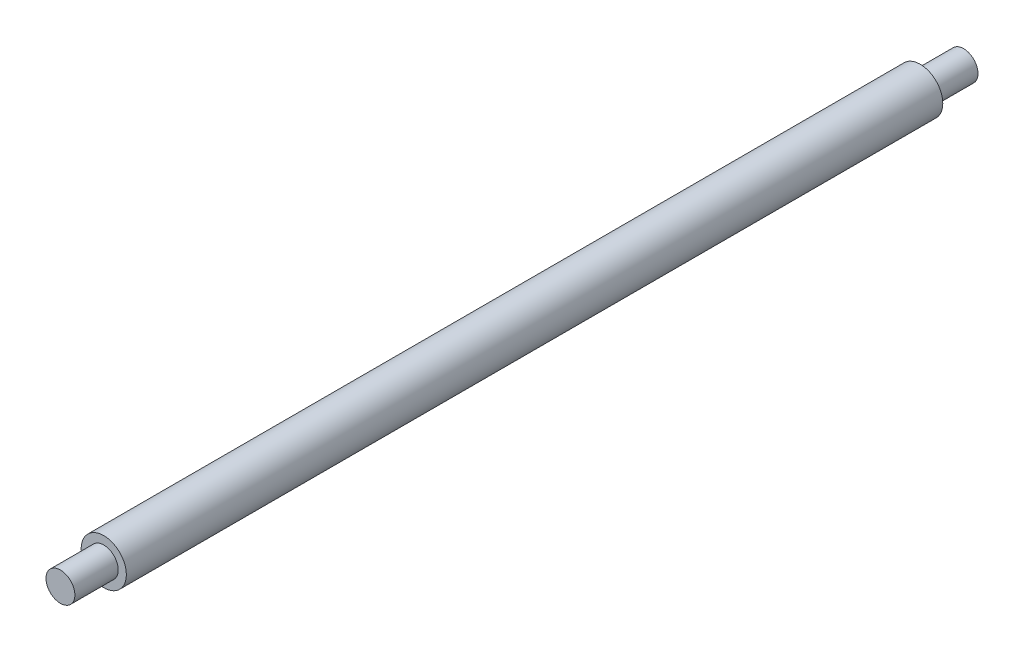
ISO-10303-21;
HEADER;
FILE_DESCRIPTION(('STEP AP214'),'2;1');
FILE_NAME('part.step','',(''),(''),'','','');
FILE_SCHEMA(('AUTOMOTIVE_DESIGN { 1 0 10303 214 1 1 1 1 }'));
ENDSEC;
DATA;
#1=APPLICATION_CONTEXT('core data for automotive mechanical design processes');
#2=APPLICATION_PROTOCOL_DEFINITION('international standard','automotive_design',2000,#1);
#3=PRODUCT_CONTEXT('',#1,'mechanical');
#4=PRODUCT('Part','Part','',(#3));
#5=PRODUCT_RELATED_PRODUCT_CATEGORY('part','',(#4));
#6=PRODUCT_DEFINITION_FORMATION('','',#4);
#7=PRODUCT_DEFINITION_CONTEXT('part definition',#1,'design');
#8=PRODUCT_DEFINITION('design','',#6,#7);
#9=PRODUCT_DEFINITION_SHAPE('','',#8);
#10=(LENGTH_UNIT() NAMED_UNIT(*) SI_UNIT(.MILLI.,.METRE.));
#11=(NAMED_UNIT(*) PLANE_ANGLE_UNIT() SI_UNIT($,.RADIAN.));
#12=(NAMED_UNIT(*) SI_UNIT($,.STERADIAN.) SOLID_ANGLE_UNIT());
#13=UNCERTAINTY_MEASURE_WITH_UNIT(LENGTH_MEASURE(1.E-05),#10,'distance_accuracy_value','');
#14=(GEOMETRIC_REPRESENTATION_CONTEXT(3) GLOBAL_UNCERTAINTY_ASSIGNED_CONTEXT((#13)) GLOBAL_UNIT_ASSIGNED_CONTEXT((#10,
#11,#12)) REPRESENTATION_CONTEXT('',''));
#15=CARTESIAN_POINT('',(0.,0.,0.));
#16=DIRECTION('',(0.,0.,1.));
#17=DIRECTION('',(1.,0.,0.));
#18=AXIS2_PLACEMENT_3D('',#15,#16,#17);
#19=CARTESIAN_POINT('',(0.,0.,-50.));
#20=DIRECTION('',(0.,0.,1.));
#21=DIRECTION('',(1.,0.,0.));
#22=AXIS2_PLACEMENT_3D('',#19,#20,#21);
#23=PLANE('',#22);
#24=CARTESIAN_POINT('',(0.,0.,-50.));
#25=DIRECTION('',(0.,0.,1.));
#26=DIRECTION('',(1.,0.,0.));
#27=AXIS2_PLACEMENT_3D('',#24,#25,#26);
#28=CIRCLE('',#27,0.800000000000001);
#29=CARTESIAN_POINT('',(0.800000000000001,0.,-50.));
#30=VERTEX_POINT('',#29);
#31=EDGE_CURVE('E18',#30,#30,#28,.T.);
#32=ORIENTED_EDGE('',*,*,#31,.F.);
#33=EDGE_LOOP('',(#32));
#34=FACE_BOUND('',#33,.T.);
#35=ADVANCED_FACE('F15',(#34),#23,.F.);
#36=CARTESIAN_POINT('',(0.,0.800000000000003,0.));
#37=DIRECTION('',(0.,0.,-1.));
#38=DIRECTION('',(-1.,0.,0.));
#39=AXIS2_PLACEMENT_3D('',#36,#37,#38);
#40=PLANE('',#39);
#41=CARTESIAN_POINT('',(0.,0.,0.));
#42=DIRECTION('',(0.,0.,1.));
#43=DIRECTION('',(1.,0.,0.));
#44=AXIS2_PLACEMENT_3D('',#41,#42,#43);
#45=CIRCLE('',#44,0.800000000000002);
#46=CARTESIAN_POINT('',(0.800000000000002,0.,0.));
#47=VERTEX_POINT('',#46);
#48=EDGE_CURVE('E34',#47,#47,#45,.F.);
#49=ORIENTED_EDGE('',*,*,#48,.F.);
#50=EDGE_LOOP('',(#49));
#51=FACE_BOUND('',#50,.T.);
#52=ADVANCED_FACE('F44',(#51),#40,.F.);
#53=CARTESIAN_POINT('',(0.,0.,0.));
#54=DIRECTION('',(0.,0.,1.));
#55=DIRECTION('',(1.,0.,0.));
#56=AXIS2_PLACEMENT_3D('',#53,#54,#55);
#57=CYLINDRICAL_SURFACE('',#56,0.800000000000001);
#58=CARTESIAN_POINT('',(0.,0.,-47.5999999999999));
#59=DIRECTION('',(0.,0.,1.));
#60=DIRECTION('',(1.,0.,0.));
#61=AXIS2_PLACEMENT_3D('',#58,#59,#60);
#62=CIRCLE('',#61,0.800000000000001);
#63=CARTESIAN_POINT('',(0.800000000000001,0.,-47.5999999999999));
#64=VERTEX_POINT('',#63);
#65=EDGE_CURVE('E32',#64,#64,#62,.F.);
#66=ORIENTED_EDGE('',*,*,#65,.T.);
#67=EDGE_LOOP('',(#66));
#68=FACE_BOUND('',#67,.T.);
#69=ORIENTED_EDGE('',*,*,#31,.T.);
#70=EDGE_LOOP('',(#69));
#71=FACE_BOUND('',#70,.T.);
#72=ADVANCED_FACE('F41',(#68,#71),#57,.T.);
#73=CARTESIAN_POINT('',(0.,0.,0.));
#74=DIRECTION('',(0.,0.,1.));
#75=DIRECTION('',(1.,0.,0.));
#76=AXIS2_PLACEMENT_3D('',#73,#74,#75);
#77=CYLINDRICAL_SURFACE('',#76,0.800000000000002);
#78=ORIENTED_EDGE('',*,*,#48,.T.);
#79=EDGE_LOOP('',(#78));
#80=FACE_BOUND('',#79,.T.);
#81=CARTESIAN_POINT('',(0.,0.,-2.4));
#82=DIRECTION('',(0.,0.,1.));
#83=DIRECTION('',(1.,0.,0.));
#84=AXIS2_PLACEMENT_3D('',#81,#82,#83);
#85=CIRCLE('',#84,0.800000000000002);
#86=CARTESIAN_POINT('',(0.800000000000002,0.,-2.4));
#87=VERTEX_POINT('',#86);
#88=EDGE_CURVE('E27',#87,#87,#85,.T.);
#89=ORIENTED_EDGE('',*,*,#88,.T.);
#90=EDGE_LOOP('',(#89));
#91=FACE_BOUND('',#90,.T.);
#92=ADVANCED_FACE('F64',(#80,#91),#77,.T.);
#93=CARTESIAN_POINT('',(0.,0.800000000000002,-47.5999999999999));
#94=DIRECTION('',(0.,0.,1.));
#95=DIRECTION('',(1.,0.,0.));
#96=AXIS2_PLACEMENT_3D('',#93,#94,#95);
#97=PLANE('',#96);
#98=ORIENTED_EDGE('',*,*,#65,.F.);
#99=EDGE_LOOP('',(#98));
#100=FACE_BOUND('',#99,.T.);
#101=CARTESIAN_POINT('',(0.,0.,-47.5999999999999));
#102=DIRECTION('',(0.,0.,1.));
#103=DIRECTION('',(1.,0.,0.));
#104=AXIS2_PLACEMENT_3D('',#101,#102,#103);
#105=CIRCLE('',#104,1.25);
#106=CARTESIAN_POINT('',(1.25,0.,-47.5999999999999));
#107=VERTEX_POINT('',#106);
#108=EDGE_CURVE('E22',#107,#107,#105,.T.);
#109=ORIENTED_EDGE('',*,*,#108,.F.);
#110=EDGE_LOOP('',(#109));
#111=FACE_BOUND('',#110,.T.);
#112=ADVANCED_FACE('F57',(#100,#111),#97,.F.);
#113=CARTESIAN_POINT('',(0.,1.24999999999999,-2.4));
#114=DIRECTION('',(0.,0.,-1.));
#115=DIRECTION('',(-1.,0.,0.));
#116=AXIS2_PLACEMENT_3D('',#113,#114,#115);
#117=PLANE('',#116);
#118=CARTESIAN_POINT('',(0.,0.,-2.4));
#119=DIRECTION('',(0.,0.,1.));
#120=DIRECTION('',(1.,0.,0.));
#121=AXIS2_PLACEMENT_3D('',#118,#119,#120);
#122=CIRCLE('',#121,1.25);
#123=CARTESIAN_POINT('',(1.25,0.,-2.4));
#124=VERTEX_POINT('',#123);
#125=EDGE_CURVE('E10',#124,#124,#122,.F.);
#126=ORIENTED_EDGE('',*,*,#125,.F.);
#127=EDGE_LOOP('',(#126));
#128=FACE_BOUND('',#127,.T.);
#129=ORIENTED_EDGE('',*,*,#88,.F.);
#130=EDGE_LOOP('',(#129));
#131=FACE_BOUND('',#130,.T.);
#132=ADVANCED_FACE('F52',(#128,#131),#117,.F.);
#133=CARTESIAN_POINT('',(0.,0.,0.));
#134=DIRECTION('',(0.,0.,1.));
#135=DIRECTION('',(1.,0.,0.));
#136=AXIS2_PLACEMENT_3D('',#133,#134,#135);
#137=CYLINDRICAL_SURFACE('',#136,1.25);
#138=ORIENTED_EDGE('',*,*,#125,.T.);
#139=EDGE_LOOP('',(#138));
#140=FACE_BOUND('',#139,.T.);
#141=ORIENTED_EDGE('',*,*,#108,.T.);
#142=EDGE_LOOP('',(#141));
#143=FACE_BOUND('',#142,.T.);
#144=ADVANCED_FACE('F50',(#140,#143),#137,.T.);
#145=CLOSED_SHELL('',(#35,#52,#72,#92,#112,#132,#144));
#146=MANIFOLD_SOLID_BREP('B1',#145);
#147=ADVANCED_BREP_SHAPE_REPRESENTATION('',(#18,#146),#14);
#148=SHAPE_DEFINITION_REPRESENTATION(#9,#147);
ENDSEC;
END-ISO-10303-21;
